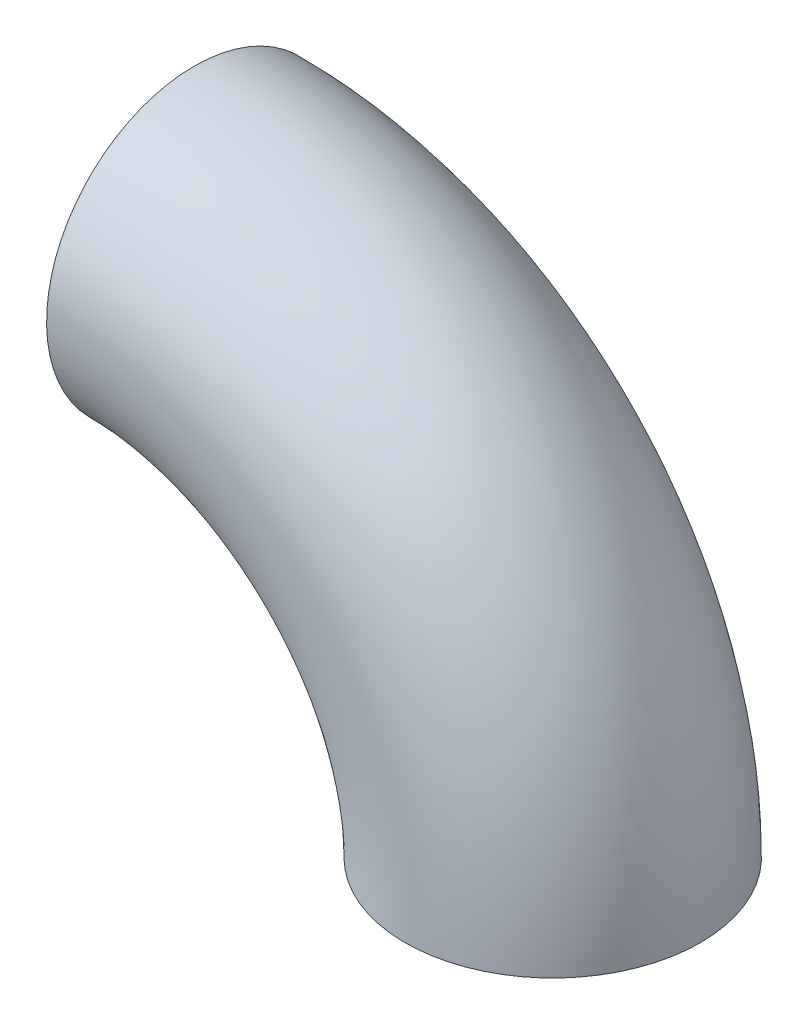
ISO-10303-21;
HEADER;
FILE_DESCRIPTION(('STEP AP214'),'2;1');
FILE_NAME('part.step','',(''),(''),'','','');
FILE_SCHEMA(('AUTOMOTIVE_DESIGN { 1 0 10303 214 1 1 1 1 }'));
ENDSEC;
DATA;
#1=APPLICATION_CONTEXT('core data for automotive mechanical design processes');
#2=APPLICATION_PROTOCOL_DEFINITION('international standard','automotive_design',2000,#1);
#3=PRODUCT_CONTEXT('',#1,'mechanical');
#4=PRODUCT('Part','Part','',(#3));
#5=PRODUCT_RELATED_PRODUCT_CATEGORY('part','',(#4));
#6=PRODUCT_DEFINITION_FORMATION('','',#4);
#7=PRODUCT_DEFINITION_CONTEXT('part definition',#1,'design');
#8=PRODUCT_DEFINITION('design','',#6,#7);
#9=PRODUCT_DEFINITION_SHAPE('','',#8);
#10=(LENGTH_UNIT() NAMED_UNIT(*) SI_UNIT(.MILLI.,.METRE.));
#11=(NAMED_UNIT(*) PLANE_ANGLE_UNIT() SI_UNIT($,.RADIAN.));
#12=(NAMED_UNIT(*) SI_UNIT($,.STERADIAN.) SOLID_ANGLE_UNIT());
#13=UNCERTAINTY_MEASURE_WITH_UNIT(LENGTH_MEASURE(1.E-05),#10,'distance_accuracy_value','');
#14=(GEOMETRIC_REPRESENTATION_CONTEXT(3) GLOBAL_UNCERTAINTY_ASSIGNED_CONTEXT((#13)) GLOBAL_UNIT_ASSIGNED_CONTEXT((#10,
#11,#12)) REPRESENTATION_CONTEXT('',''));
#15=CARTESIAN_POINT('',(0.,0.,0.));
#16=DIRECTION('',(0.,0.,1.));
#17=DIRECTION('',(1.,0.,0.));
#18=AXIS2_PLACEMENT_3D('',#15,#16,#17);
#19=CARTESIAN_POINT('',(-53.975,0.,0.));
#20=DIRECTION('',(0.,0.,-1.));
#21=DIRECTION('',(-1.,0.,0.));
#22=AXIS2_PLACEMENT_3D('',#19,#20,#21);
#23=TOROIDAL_SURFACE('',#22,53.975,20.574);
#24=CARTESIAN_POINT('',(-53.975,53.975,0.));
#25=DIRECTION('',(-1.,0.,0.));
#26=DIRECTION('',(0.,0.,1.));
#27=AXIS2_PLACEMENT_3D('',#24,#25,#26);
#28=CIRCLE('',#27,20.574);
#29=CARTESIAN_POINT('',(-53.975,74.549,0.));
#30=VERTEX_POINT('',#29);
#31=EDGE_CURVE('E38',#30,#30,#28,.T.);
#32=CARTESIAN_POINT('',(0.,0.,0.));
#33=DIRECTION('',(0.,1.,0.));
#34=DIRECTION('',(0.,0.,1.));
#35=AXIS2_PLACEMENT_3D('',#32,#33,#34);
#36=CIRCLE('',#35,20.574);
#37=CARTESIAN_POINT('',(20.574,0.,0.));
#38=VERTEX_POINT('',#37);
#39=EDGE_CURVE('E46',#38,#38,#36,.T.);
#40=CARTESIAN_POINT('',(-53.975,0.,0.));
#41=DIRECTION('',(0.,0.,-1.));
#42=DIRECTION('',(-1.,0.,0.));
#43=AXIS2_PLACEMENT_3D('',#40,#41,#42);
#44=CIRCLE('',#43,74.549);
#45=EDGE_CURVE('',#30,#38,#44,.T.);
#46=ORIENTED_EDGE('',*,*,#31,.T.);
#47=ORIENTED_EDGE('',*,*,#39,.F.);
#48=ORIENTED_EDGE('',*,*,#45,.T.);
#49=ORIENTED_EDGE('',*,*,#45,.F.);
#50=EDGE_LOOP('',(#46,#48,#47,#49));
#51=FACE_BOUND('',#50,.T.);
#52=ADVANCED_FACE('F31',(#51),#23,.F.);
#53=CARTESIAN_POINT('',(-53.975,0.,0.));
#54=DIRECTION('',(0.,0.,-1.));
#55=DIRECTION('',(-1.,0.,0.));
#56=AXIS2_PLACEMENT_3D('',#53,#54,#55);
#57=TOROIDAL_SURFACE('',#56,53.975,22.225);
#58=CARTESIAN_POINT('',(-53.975,53.975,0.));
#59=DIRECTION('',(-1.,0.,0.));
#60=DIRECTION('',(0.,0.,1.));
#61=AXIS2_PLACEMENT_3D('',#58,#59,#60);
#62=CIRCLE('',#61,22.225);
#63=CARTESIAN_POINT('',(-53.975,76.2,0.));
#64=VERTEX_POINT('',#63);
#65=EDGE_CURVE('E10',#64,#64,#62,.T.);
#66=CARTESIAN_POINT('',(0.,0.,0.));
#67=DIRECTION('',(0.,1.,0.));
#68=DIRECTION('',(0.,0.,1.));
#69=AXIS2_PLACEMENT_3D('',#66,#67,#68);
#70=CIRCLE('',#69,22.225);
#71=CARTESIAN_POINT('',(22.225,0.,0.));
#72=VERTEX_POINT('',#71);
#73=EDGE_CURVE('E42',#72,#72,#70,.T.);
#74=CARTESIAN_POINT('',(-53.975,0.,0.));
#75=DIRECTION('',(0.,0.,-1.));
#76=DIRECTION('',(-1.,0.,0.));
#77=AXIS2_PLACEMENT_3D('',#74,#75,#76);
#78=CIRCLE('',#77,76.2);
#79=EDGE_CURVE('',#64,#72,#78,.T.);
#80=ORIENTED_EDGE('',*,*,#65,.F.);
#81=ORIENTED_EDGE('',*,*,#73,.T.);
#82=ORIENTED_EDGE('',*,*,#79,.T.);
#83=ORIENTED_EDGE('',*,*,#79,.F.);
#84=EDGE_LOOP('',(#80,#82,#81,#83));
#85=FACE_BOUND('',#84,.T.);
#86=ADVANCED_FACE('F33',(#85),#57,.T.);
#87=CARTESIAN_POINT('',(-53.975,53.975,0.));
#88=DIRECTION('',(-1.,0.,0.));
#89=DIRECTION('',(0.,0.,1.));
#90=AXIS2_PLACEMENT_3D('',#87,#88,#89);
#91=PLANE('',#90);
#92=ORIENTED_EDGE('',*,*,#31,.F.);
#93=EDGE_LOOP('',(#92));
#94=FACE_BOUND('',#93,.T.);
#95=ORIENTED_EDGE('',*,*,#65,.T.);
#96=EDGE_LOOP('',(#95));
#97=FACE_BOUND('',#96,.T.);
#98=ADVANCED_FACE('F59',(#94,#97),#91,.T.);
#99=CARTESIAN_POINT('',(0.,0.,0.));
#100=DIRECTION('',(0.,1.,0.));
#101=DIRECTION('',(0.,0.,1.));
#102=AXIS2_PLACEMENT_3D('',#99,#100,#101);
#103=PLANE('',#102);
#104=ORIENTED_EDGE('',*,*,#39,.T.);
#105=EDGE_LOOP('',(#104));
#106=FACE_BOUND('',#105,.T.);
#107=ORIENTED_EDGE('',*,*,#73,.F.);
#108=EDGE_LOOP('',(#107));
#109=FACE_BOUND('',#108,.T.);
#110=ADVANCED_FACE('F52',(#106,#109),#103,.F.);
#111=CLOSED_SHELL('',(#52,#86,#98,#110));
#112=MANIFOLD_SOLID_BREP('B2',#111);
#113=ADVANCED_BREP_SHAPE_REPRESENTATION('',(#18,#112),#14);
#114=SHAPE_DEFINITION_REPRESENTATION(#9,#113);
ENDSEC;
END-ISO-10303-21;
